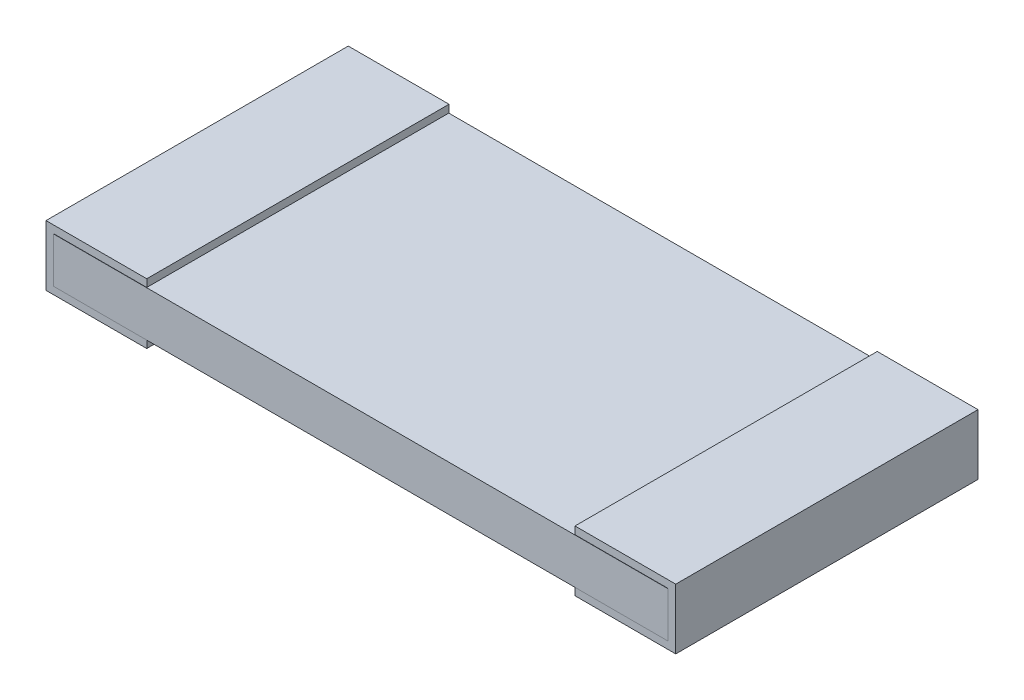
ISO-10303-21;
HEADER;
FILE_DESCRIPTION(('STEP AP214'),'2;1');
FILE_NAME('part.step','',(''),(''),'','','');
FILE_SCHEMA(('AUTOMOTIVE_DESIGN { 1 0 10303 214 1 1 1 1 }'));
ENDSEC;
DATA;
#1=APPLICATION_CONTEXT('core data for automotive mechanical design processes');
#2=APPLICATION_PROTOCOL_DEFINITION('international standard','automotive_design',2000,#1);
#3=PRODUCT_CONTEXT('',#1,'mechanical');
#4=PRODUCT('Part','Part','',(#3));
#5=PRODUCT_RELATED_PRODUCT_CATEGORY('part','',(#4));
#6=PRODUCT_DEFINITION_FORMATION('','',#4);
#7=PRODUCT_DEFINITION_CONTEXT('part definition',#1,'design');
#8=PRODUCT_DEFINITION('design','',#6,#7);
#9=PRODUCT_DEFINITION_SHAPE('','',#8);
#10=(LENGTH_UNIT() NAMED_UNIT(*) SI_UNIT(.MILLI.,.METRE.));
#11=(NAMED_UNIT(*) PLANE_ANGLE_UNIT() SI_UNIT($,.RADIAN.));
#12=(NAMED_UNIT(*) SI_UNIT($,.STERADIAN.) SOLID_ANGLE_UNIT());
#13=UNCERTAINTY_MEASURE_WITH_UNIT(LENGTH_MEASURE(1.E-05),#10,'distance_accuracy_value','');
#14=(GEOMETRIC_REPRESENTATION_CONTEXT(3) GLOBAL_UNCERTAINTY_ASSIGNED_CONTEXT((#13)) GLOBAL_UNIT_ASSIGNED_CONTEXT((#10,
#11,#12)) REPRESENTATION_CONTEXT('',''));
#15=CARTESIAN_POINT('',(0.,0.,0.));
#16=DIRECTION('',(0.,0.,1.));
#17=DIRECTION('',(1.,0.,0.));
#18=AXIS2_PLACEMENT_3D('',#15,#16,#17);
#19=CARTESIAN_POINT('',(6.2738,0.0762000000000008,-1.524));
#20=DIRECTION('',(1.,0.,0.));
#21=DIRECTION('',(0.,0.,-1.));
#22=AXIS2_PLACEMENT_3D('',#19,#20,#21);
#23=PLANE('',#22);
#24=DIRECTION('',(0.,0.,1.));
#25=VECTOR('',#24,1.);
#26=CARTESIAN_POINT('',(6.2738,0.0762000000000008,-1.524));
#27=LINE('',#26,#25);
#28=CARTESIAN_POINT('',(6.2738,0.0762000000000008,1.52146));
#29=VERTEX_POINT('',#28);
#30=CARTESIAN_POINT('',(6.2738,0.0762000000000008,1.524));
#31=VERTEX_POINT('',#30);
#32=EDGE_CURVE('E11',#29,#31,#27,.T.);
#33=ORIENTED_EDGE('',*,*,#32,.F.);
#34=DIRECTION('',(0.,-1.,0.));
#35=VECTOR('',#34,1.);
#36=CARTESIAN_POINT('',(6.2738,0.5334,1.52146));
#37=LINE('',#36,#35);
#38=CARTESIAN_POINT('',(6.2738,0.5334,1.52146));
#39=VERTEX_POINT('',#38);
#40=EDGE_CURVE('E212',#39,#29,#37,.T.);
#41=ORIENTED_EDGE('',*,*,#40,.F.);
#42=DIRECTION('',(0.,0.,1.));
#43=VECTOR('',#42,1.);
#44=CARTESIAN_POINT('',(6.2738,0.5334,-1.524));
#45=LINE('',#44,#43);
#46=CARTESIAN_POINT('',(6.2738,0.5334,1.524));
#47=VERTEX_POINT('',#46);
#48=EDGE_CURVE('E34',#39,#47,#45,.T.);
#49=ORIENTED_EDGE('',*,*,#48,.T.);
#50=DIRECTION('',(0.,1.,0.));
#51=VECTOR('',#50,1.);
#52=CARTESIAN_POINT('',(6.2738,0.0762000000000008,1.524));
#53=LINE('',#52,#51);
#54=EDGE_CURVE('E300',#31,#47,#53,.T.);
#55=ORIENTED_EDGE('',*,*,#54,.F.);
#56=EDGE_LOOP('',(#33,#41,#49,#55));
#57=FACE_BOUND('',#56,.T.);
#58=ADVANCED_FACE('F31',(#57),#23,.T.);
#59=CARTESIAN_POINT('',(6.2738,0.0762000000000008,-1.524));
#60=DIRECTION('',(0.,-1.,0.));
#61=DIRECTION('',(1.,0.,0.));
#62=AXIS2_PLACEMENT_3D('',#59,#60,#61);
#63=PLANE('',#62);
#64=DIRECTION('',(1.,0.,0.));
#65=VECTOR('',#64,1.);
#66=CARTESIAN_POINT('',(6.2738,0.0762000000000008,-1.524));
#67=LINE('',#66,#65);
#68=CARTESIAN_POINT('',(1.016,0.0762000000000003,-1.524));
#69=VERTEX_POINT('',#68);
#70=CARTESIAN_POINT('',(5.334,0.0762000000000007,-1.524));
#71=VERTEX_POINT('',#70);
#72=EDGE_CURVE('E333',#69,#71,#67,.T.);
#73=ORIENTED_EDGE('',*,*,#72,.T.);
#74=DIRECTION('',(0.,0.,-1.));
#75=VECTOR('',#74,1.);
#76=CARTESIAN_POINT('',(5.334,0.0762000000000003,1.52146));
#77=LINE('',#76,#75);
#78=CARTESIAN_POINT('',(5.334,0.0762000000000007,1.52146));
#79=VERTEX_POINT('',#78);
#80=EDGE_CURVE('E47',#79,#71,#77,.T.);
#81=ORIENTED_EDGE('',*,*,#80,.F.);
#82=DIRECTION('',(-1.,0.,0.));
#83=VECTOR('',#82,1.);
#84=CARTESIAN_POINT('',(6.2738,0.0762000000000002,1.52146));
#85=LINE('',#84,#83);
#86=EDGE_CURVE('E50',#29,#79,#85,.T.);
#87=ORIENTED_EDGE('',*,*,#86,.F.);
#88=ORIENTED_EDGE('',*,*,#32,.T.);
#89=DIRECTION('',(1.,0.,0.));
#90=VECTOR('',#89,1.);
#91=CARTESIAN_POINT('',(6.2738,0.0762000000000008,1.524));
#92=LINE('',#91,#90);
#93=CARTESIAN_POINT('',(0.0762,0.0762000000000002,1.524));
#94=VERTEX_POINT('',#93);
#95=EDGE_CURVE('E321',#94,#31,#92,.T.);
#96=ORIENTED_EDGE('',*,*,#95,.F.);
#97=DIRECTION('',(0.,0.,1.));
#98=VECTOR('',#97,1.);
#99=CARTESIAN_POINT('',(0.0762,0.0762000000000002,-1.524));
#100=LINE('',#99,#98);
#101=CARTESIAN_POINT('',(0.0762,0.0762000000000002,1.52146));
#102=VERTEX_POINT('',#101);
#103=EDGE_CURVE('E39',#102,#94,#100,.T.);
#104=ORIENTED_EDGE('',*,*,#103,.F.);
#105=DIRECTION('',(1.,0.,0.));
#106=VECTOR('',#105,1.);
#107=CARTESIAN_POINT('',(0.0762,0.0762000000000002,1.52146));
#108=LINE('',#107,#106);
#109=CARTESIAN_POINT('',(1.016,0.0762000000000003,1.52146));
#110=VERTEX_POINT('',#109);
#111=EDGE_CURVE('E267',#102,#110,#108,.T.);
#112=ORIENTED_EDGE('',*,*,#111,.T.);
#113=DIRECTION('',(0.,0.,-1.));
#114=VECTOR('',#113,1.);
#115=CARTESIAN_POINT('',(1.016,0.0762000000000003,1.52146));
#116=LINE('',#115,#114);
#117=EDGE_CURVE('E303',#110,#69,#116,.T.);
#118=ORIENTED_EDGE('',*,*,#117,.T.);
#119=EDGE_LOOP('',(#73,#81,#87,#88,#96,#104,#112,#118));
#120=FACE_BOUND('',#119,.T.);
#121=ADVANCED_FACE('F357',(#120),#63,.T.);
#122=CARTESIAN_POINT('',(0.0761999999999999,0.5334,-1.524));
#123=DIRECTION('',(0.,1.,0.));
#124=DIRECTION('',(0.,0.,1.));
#125=AXIS2_PLACEMENT_3D('',#122,#123,#124);
#126=PLANE('',#125);
#127=DIRECTION('',(1.,0.,0.));
#128=VECTOR('',#127,1.);
#129=CARTESIAN_POINT('',(5.334,0.5334,1.52146));
#130=LINE('',#129,#128);
#131=CARTESIAN_POINT('',(5.334,0.5334,1.52146));
#132=VERTEX_POINT('',#131);
#133=EDGE_CURVE('E215',#132,#39,#130,.T.);
#134=ORIENTED_EDGE('',*,*,#133,.F.);
#135=DIRECTION('',(0.,0.,-1.));
#136=VECTOR('',#135,1.);
#137=CARTESIAN_POINT('',(5.334,0.5334,1.52146));
#138=LINE('',#137,#136);
#139=CARTESIAN_POINT('',(5.334,0.5334,-1.524));
#140=VERTEX_POINT('',#139);
#141=EDGE_CURVE('E243',#132,#140,#138,.T.);
#142=ORIENTED_EDGE('',*,*,#141,.T.);
#143=DIRECTION('',(-1.,0.,0.));
#144=VECTOR('',#143,1.);
#145=CARTESIAN_POINT('',(0.0761999999999999,0.5334,-1.524));
#146=LINE('',#145,#144);
#147=CARTESIAN_POINT('',(1.016,0.5334,-1.524));
#148=VERTEX_POINT('',#147);
#149=EDGE_CURVE('E326',#140,#148,#146,.T.);
#150=ORIENTED_EDGE('',*,*,#149,.T.);
#151=DIRECTION('',(0.,0.,-1.));
#152=VECTOR('',#151,1.);
#153=CARTESIAN_POINT('',(1.016,0.5334,1.52146));
#154=LINE('',#153,#152);
#155=CARTESIAN_POINT('',(1.016,0.5334,1.52146));
#156=VERTEX_POINT('',#155);
#157=EDGE_CURVE('E310',#156,#148,#154,.T.);
#158=ORIENTED_EDGE('',*,*,#157,.F.);
#159=DIRECTION('',(-1.,0.,0.));
#160=VECTOR('',#159,1.);
#161=CARTESIAN_POINT('',(1.016,0.5334,1.52146));
#162=LINE('',#161,#160);
#163=CARTESIAN_POINT('',(0.0761999999999999,0.5334,1.52146));
#164=VERTEX_POINT('',#163);
#165=EDGE_CURVE('E263',#156,#164,#162,.T.);
#166=ORIENTED_EDGE('',*,*,#165,.T.);
#167=DIRECTION('',(0.,0.,1.));
#168=VECTOR('',#167,1.);
#169=CARTESIAN_POINT('',(0.0761999999999999,0.5334,-1.524));
#170=LINE('',#169,#168);
#171=CARTESIAN_POINT('',(0.0761999999999999,0.5334,1.524));
#172=VERTEX_POINT('',#171);
#173=EDGE_CURVE('E344',#164,#172,#170,.T.);
#174=ORIENTED_EDGE('',*,*,#173,.T.);
#175=DIRECTION('',(-1.,0.,0.));
#176=VECTOR('',#175,1.);
#177=CARTESIAN_POINT('',(0.0761999999999999,0.5334,1.524));
#178=LINE('',#177,#176);
#179=EDGE_CURVE('E336',#47,#172,#178,.T.);
#180=ORIENTED_EDGE('',*,*,#179,.F.);
#181=ORIENTED_EDGE('',*,*,#48,.F.);
#182=EDGE_LOOP('',(#134,#142,#150,#158,#166,#174,#180,#181));
#183=FACE_BOUND('',#182,.T.);
#184=ADVANCED_FACE('F352',(#183),#126,.T.);
#185=CARTESIAN_POINT('',(0.0761999999999999,0.5334,-1.524));
#186=DIRECTION('',(-1.,0.,0.));
#187=DIRECTION('',(0.,-1.,0.));
#188=AXIS2_PLACEMENT_3D('',#185,#186,#187);
#189=PLANE('',#188);
#190=ORIENTED_EDGE('',*,*,#173,.F.);
#191=DIRECTION('',(0.,-1.,0.));
#192=VECTOR('',#191,1.);
#193=CARTESIAN_POINT('',(0.0761999999999999,0.5334,1.52146));
#194=LINE('',#193,#192);
#195=EDGE_CURVE('E265',#164,#102,#194,.T.);
#196=ORIENTED_EDGE('',*,*,#195,.T.);
#197=ORIENTED_EDGE('',*,*,#103,.T.);
#198=DIRECTION('',(0.,-1.,0.));
#199=VECTOR('',#198,1.);
#200=CARTESIAN_POINT('',(0.0761999999999999,0.5334,1.524));
#201=LINE('',#200,#199);
#202=EDGE_CURVE('E339',#172,#94,#201,.T.);
#203=ORIENTED_EDGE('',*,*,#202,.F.);
#204=EDGE_LOOP('',(#190,#196,#197,#203));
#205=FACE_BOUND('',#204,.T.);
#206=ADVANCED_FACE('F420',(#205),#189,.T.);
#207=CARTESIAN_POINT('',(6.2738,0.5334,-1.524));
#208=DIRECTION('',(0.,0.,-1.));
#209=DIRECTION('',(-1.,0.,0.));
#210=AXIS2_PLACEMENT_3D('',#207,#208,#209);
#211=PLANE('',#210);
#212=DIRECTION('',(0.,1.,0.));
#213=VECTOR('',#212,1.);
#214=CARTESIAN_POINT('',(6.2738,0.0762000000000008,-1.524));
#215=LINE('',#214,#213);
#216=CARTESIAN_POINT('',(6.2738,0.0762000000000002,-1.524));
#217=VERTEX_POINT('',#216);
#218=CARTESIAN_POINT('',(6.2738,0.5334,-1.524));
#219=VERTEX_POINT('',#218);
#220=EDGE_CURVE('E317',#217,#219,#215,.T.);
#221=ORIENTED_EDGE('',*,*,#220,.F.);
#222=EDGE_CURVE('E329',#71,#217,#67,.T.);
#223=ORIENTED_EDGE('',*,*,#222,.F.);
#224=ORIENTED_EDGE('',*,*,#72,.F.);
#225=CARTESIAN_POINT('',(0.0762,0.0762000000000002,-1.524));
#226=VERTEX_POINT('',#225);
#227=EDGE_CURVE('E330',#226,#69,#67,.T.);
#228=ORIENTED_EDGE('',*,*,#227,.F.);
#229=DIRECTION('',(0.,-1.,0.));
#230=VECTOR('',#229,1.);
#231=CARTESIAN_POINT('',(0.0761999999999999,0.5334,-1.524));
#232=LINE('',#231,#230);
#233=CARTESIAN_POINT('',(0.0761999999999999,0.5334,-1.524));
#234=VERTEX_POINT('',#233);
#235=EDGE_CURVE('E325',#234,#226,#232,.T.);
#236=ORIENTED_EDGE('',*,*,#235,.F.);
#237=EDGE_CURVE('E320',#148,#234,#146,.T.);
#238=ORIENTED_EDGE('',*,*,#237,.F.);
#239=ORIENTED_EDGE('',*,*,#149,.F.);
#240=EDGE_CURVE('E322',#219,#140,#146,.T.);
#241=ORIENTED_EDGE('',*,*,#240,.F.);
#242=EDGE_LOOP('',(#221,#223,#224,#228,#236,#238,#239,#241));
#243=FACE_BOUND('',#242,.T.);
#244=ADVANCED_FACE('F366',(#243),#211,.T.);
#245=CARTESIAN_POINT('',(6.2738,0.5334,1.524));
#246=DIRECTION('',(0.,0.,-1.));
#247=DIRECTION('',(-1.,0.,0.));
#248=AXIS2_PLACEMENT_3D('',#245,#246,#247);
#249=PLANE('',#248);
#250=ORIENTED_EDGE('',*,*,#54,.T.);
#251=ORIENTED_EDGE('',*,*,#179,.T.);
#252=ORIENTED_EDGE('',*,*,#202,.T.);
#253=ORIENTED_EDGE('',*,*,#95,.T.);
#254=EDGE_LOOP('',(#250,#251,#252,#253));
#255=FACE_BOUND('',#254,.T.);
#256=ADVANCED_FACE('F354',(#255),#249,.F.);
#257=CARTESIAN_POINT('',(0.,0.,1.52146));
#258=DIRECTION('',(-1.,0.,0.));
#259=DIRECTION('',(0.,0.,1.));
#260=AXIS2_PLACEMENT_3D('',#257,#258,#259);
#261=PLANE('',#260);
#262=DIRECTION('',(0.,1.,0.));
#263=VECTOR('',#262,1.);
#264=CARTESIAN_POINT('',(0.,0.,-1.52654));
#265=LINE('',#264,#263);
#266=CARTESIAN_POINT('',(0.,0.,-1.52654));
#267=VERTEX_POINT('',#266);
#268=CARTESIAN_POINT('',(0.,0.6096,-1.52654));
#269=VERTEX_POINT('',#268);
#270=EDGE_CURVE('E239',#267,#269,#265,.T.);
#271=ORIENTED_EDGE('',*,*,#270,.F.);
#272=DIRECTION('',(0.,0.,-1.));
#273=VECTOR('',#272,1.);
#274=CARTESIAN_POINT('',(0.,0.,1.52146));
#275=LINE('',#274,#273);
#276=CARTESIAN_POINT('',(0.,0.,1.52146));
#277=VERTEX_POINT('',#276);
#278=EDGE_CURVE('E298',#277,#267,#275,.T.);
#279=ORIENTED_EDGE('',*,*,#278,.F.);
#280=DIRECTION('',(0.,1.,0.));
#281=VECTOR('',#280,1.);
#282=CARTESIAN_POINT('',(0.,0.,1.52146));
#283=LINE('',#282,#281);
#284=CARTESIAN_POINT('',(0.,0.6096,1.52146));
#285=VERTEX_POINT('',#284);
#286=EDGE_CURVE('E253',#277,#285,#283,.T.);
#287=ORIENTED_EDGE('',*,*,#286,.T.);
#288=DIRECTION('',(0.,0.,-1.));
#289=VECTOR('',#288,1.);
#290=CARTESIAN_POINT('',(0.,0.6096,1.52146));
#291=LINE('',#290,#289);
#292=EDGE_CURVE('E275',#285,#269,#291,.T.);
#293=ORIENTED_EDGE('',*,*,#292,.T.);
#294=EDGE_LOOP('',(#271,#279,#287,#293));
#295=FACE_BOUND('',#294,.T.);
#296=ADVANCED_FACE('F437',(#295),#261,.T.);
#297=CARTESIAN_POINT('',(0.,0.,1.52146));
#298=DIRECTION('',(0.,-1.,0.));
#299=DIRECTION('',(1.,0.,0.));
#300=AXIS2_PLACEMENT_3D('',#297,#298,#299);
#301=PLANE('',#300);
#302=DIRECTION('',(-1.,0.,0.));
#303=VECTOR('',#302,1.);
#304=CARTESIAN_POINT('',(0.,0.,-1.52654));
#305=LINE('',#304,#303);
#306=CARTESIAN_POINT('',(1.016,0.,-1.52654));
#307=VERTEX_POINT('',#306);
#308=EDGE_CURVE('E257',#307,#267,#305,.T.);
#309=ORIENTED_EDGE('',*,*,#308,.F.);
#310=DIRECTION('',(0.,0.,-1.));
#311=VECTOR('',#310,1.);
#312=CARTESIAN_POINT('',(1.016,0.,1.52146));
#313=LINE('',#312,#311);
#314=CARTESIAN_POINT('',(1.016,0.,1.52146));
#315=VERTEX_POINT('',#314);
#316=EDGE_CURVE('E301',#315,#307,#313,.T.);
#317=ORIENTED_EDGE('',*,*,#316,.F.);
#318=DIRECTION('',(-1.,0.,0.));
#319=VECTOR('',#318,1.);
#320=CARTESIAN_POINT('',(0.,0.,1.52146));
#321=LINE('',#320,#319);
#322=EDGE_CURVE('E272',#315,#277,#321,.T.);
#323=ORIENTED_EDGE('',*,*,#322,.T.);
#324=ORIENTED_EDGE('',*,*,#278,.T.);
#325=EDGE_LOOP('',(#309,#317,#323,#324));
#326=FACE_BOUND('',#325,.T.);
#327=ADVANCED_FACE('F441',(#326),#301,.T.);
#328=CARTESIAN_POINT('',(1.016,0.,1.52146));
#329=DIRECTION('',(1.,0.,0.));
#330=DIRECTION('',(0.,0.,-1.));
#331=AXIS2_PLACEMENT_3D('',#328,#329,#330);
#332=PLANE('',#331);
#333=DIRECTION('',(0.,-1.,0.));
#334=VECTOR('',#333,1.);
#335=CARTESIAN_POINT('',(1.016,0.,-1.52654));
#336=LINE('',#335,#334);
#337=CARTESIAN_POINT('',(1.016,0.0762000000000003,-1.52654));
#338=VERTEX_POINT('',#337);
#339=EDGE_CURVE('E293',#338,#307,#336,.T.);
#340=ORIENTED_EDGE('',*,*,#339,.F.);
#341=EDGE_CURVE('E305',#69,#338,#116,.T.);
#342=ORIENTED_EDGE('',*,*,#341,.F.);
#343=ORIENTED_EDGE('',*,*,#117,.F.);
#344=DIRECTION('',(0.,-1.,0.));
#345=VECTOR('',#344,1.);
#346=CARTESIAN_POINT('',(1.016,0.,1.52146));
#347=LINE('',#346,#345);
#348=EDGE_CURVE('E269',#110,#315,#347,.T.);
#349=ORIENTED_EDGE('',*,*,#348,.T.);
#350=ORIENTED_EDGE('',*,*,#316,.T.);
#351=EDGE_LOOP('',(#340,#342,#343,#349,#350));
#352=FACE_BOUND('',#351,.T.);
#353=ADVANCED_FACE('F397',(#352),#332,.T.);
#354=CARTESIAN_POINT('',(0.0762,0.0762000000000002,1.52146));
#355=DIRECTION('',(0.,1.,0.));
#356=DIRECTION('',(-1.,0.,0.));
#357=AXIS2_PLACEMENT_3D('',#354,#355,#356);
#358=PLANE('',#357);
#359=DIRECTION('',(0.,0.,-1.));
#360=VECTOR('',#359,1.);
#361=CARTESIAN_POINT('',(0.0762,0.0762000000000002,1.52146));
#362=LINE('',#361,#360);
#363=CARTESIAN_POINT('',(0.0762,0.0762000000000002,-1.52654));
#364=VERTEX_POINT('',#363);
#365=EDGE_CURVE('E306',#226,#364,#362,.T.);
#366=ORIENTED_EDGE('',*,*,#365,.F.);
#367=ORIENTED_EDGE('',*,*,#227,.T.);
#368=ORIENTED_EDGE('',*,*,#341,.T.);
#369=DIRECTION('',(1.,0.,0.));
#370=VECTOR('',#369,1.);
#371=CARTESIAN_POINT('',(0.0762,0.0762000000000002,-1.52654));
#372=LINE('',#371,#370);
#373=EDGE_CURVE('E290',#364,#338,#372,.T.);
#374=ORIENTED_EDGE('',*,*,#373,.F.);
#375=EDGE_LOOP('',(#366,#367,#368,#374));
#376=FACE_BOUND('',#375,.T.);
#377=ADVANCED_FACE('F393',(#376),#358,.T.);
#378=CARTESIAN_POINT('',(0.0761999999999999,0.5334,1.52146));
#379=DIRECTION('',(1.,0.,0.));
#380=DIRECTION('',(0.,1.,0.));
#381=AXIS2_PLACEMENT_3D('',#378,#379,#380);
#382=PLANE('',#381);
#383=DIRECTION('',(0.,0.,-1.));
#384=VECTOR('',#383,1.);
#385=CARTESIAN_POINT('',(0.0761999999999999,0.5334,1.52146));
#386=LINE('',#385,#384);
#387=CARTESIAN_POINT('',(0.0761999999999999,0.5334,-1.52654));
#388=VERTEX_POINT('',#387);
#389=EDGE_CURVE('E308',#234,#388,#386,.T.);
#390=ORIENTED_EDGE('',*,*,#389,.F.);
#391=ORIENTED_EDGE('',*,*,#235,.T.);
#392=ORIENTED_EDGE('',*,*,#365,.T.);
#393=DIRECTION('',(0.,-1.,0.));
#394=VECTOR('',#393,1.);
#395=CARTESIAN_POINT('',(0.0761999999999999,0.5334,-1.52654));
#396=LINE('',#395,#394);
#397=EDGE_CURVE('E287',#388,#364,#396,.T.);
#398=ORIENTED_EDGE('',*,*,#397,.F.);
#399=EDGE_LOOP('',(#390,#391,#392,#398));
#400=FACE_BOUND('',#399,.T.);
#401=ADVANCED_FACE('F406',(#400),#382,.T.);
#402=CARTESIAN_POINT('',(1.016,0.5334,1.52146));
#403=DIRECTION('',(0.,-1.,0.));
#404=DIRECTION('',(0.,0.,-1.));
#405=AXIS2_PLACEMENT_3D('',#402,#403,#404);
#406=PLANE('',#405);
#407=CARTESIAN_POINT('',(1.016,0.5334,-1.52654));
#408=VERTEX_POINT('',#407);
#409=EDGE_CURVE('E313',#148,#408,#154,.T.);
#410=ORIENTED_EDGE('',*,*,#409,.F.);
#411=ORIENTED_EDGE('',*,*,#237,.T.);
#412=ORIENTED_EDGE('',*,*,#389,.T.);
#413=DIRECTION('',(-1.,0.,0.));
#414=VECTOR('',#413,1.);
#415=CARTESIAN_POINT('',(1.016,0.5334,-1.52654));
#416=LINE('',#415,#414);
#417=EDGE_CURVE('E284',#408,#388,#416,.T.);
#418=ORIENTED_EDGE('',*,*,#417,.F.);
#419=EDGE_LOOP('',(#410,#411,#412,#418));
#420=FACE_BOUND('',#419,.T.);
#421=ADVANCED_FACE('F408',(#420),#406,.T.);
#422=CARTESIAN_POINT('',(1.016,0.6096,1.52146));
#423=DIRECTION('',(1.,0.,0.));
#424=DIRECTION('',(0.,1.,0.));
#425=AXIS2_PLACEMENT_3D('',#422,#423,#424);
#426=PLANE('',#425);
#427=DIRECTION('',(0.,-1.,0.));
#428=VECTOR('',#427,1.);
#429=CARTESIAN_POINT('',(1.016,0.6096,-1.52654));
#430=LINE('',#429,#428);
#431=CARTESIAN_POINT('',(1.016,0.6096,-1.52654));
#432=VERTEX_POINT('',#431);
#433=EDGE_CURVE('E281',#432,#408,#430,.T.);
#434=ORIENTED_EDGE('',*,*,#433,.F.);
#435=DIRECTION('',(0.,0.,-1.));
#436=VECTOR('',#435,1.);
#437=CARTESIAN_POINT('',(1.016,0.6096,1.52146));
#438=LINE('',#437,#436);
#439=CARTESIAN_POINT('',(1.016,0.6096,1.52146));
#440=VERTEX_POINT('',#439);
#441=EDGE_CURVE('E314',#440,#432,#438,.T.);
#442=ORIENTED_EDGE('',*,*,#441,.F.);
#443=DIRECTION('',(0.,-1.,0.));
#444=VECTOR('',#443,1.);
#445=CARTESIAN_POINT('',(1.016,0.6096,1.52146));
#446=LINE('',#445,#444);
#447=EDGE_CURVE('E260',#440,#156,#446,.T.);
#448=ORIENTED_EDGE('',*,*,#447,.T.);
#449=ORIENTED_EDGE('',*,*,#157,.T.);
#450=ORIENTED_EDGE('',*,*,#409,.T.);
#451=EDGE_LOOP('',(#434,#442,#448,#449,#450));
#452=FACE_BOUND('',#451,.T.);
#453=ADVANCED_FACE('F411',(#452),#426,.T.);
#454=CARTESIAN_POINT('',(0.,0.6096,1.52146));
#455=DIRECTION('',(0.,1.,0.));
#456=DIRECTION('',(0.,0.,1.));
#457=AXIS2_PLACEMENT_3D('',#454,#455,#456);
#458=PLANE('',#457);
#459=DIRECTION('',(1.,0.,0.));
#460=VECTOR('',#459,1.);
#461=CARTESIAN_POINT('',(0.,0.6096,-1.52654));
#462=LINE('',#461,#460);
#463=EDGE_CURVE('E278',#269,#432,#462,.T.);
#464=ORIENTED_EDGE('',*,*,#463,.F.);
#465=ORIENTED_EDGE('',*,*,#292,.F.);
#466=DIRECTION('',(1.,0.,0.));
#467=VECTOR('',#466,1.);
#468=CARTESIAN_POINT('',(0.,0.6096,1.52146));
#469=LINE('',#468,#467);
#470=EDGE_CURVE('E256',#285,#440,#469,.T.);
#471=ORIENTED_EDGE('',*,*,#470,.T.);
#472=ORIENTED_EDGE('',*,*,#441,.T.);
#473=EDGE_LOOP('',(#464,#465,#471,#472));
#474=FACE_BOUND('',#473,.T.);
#475=ADVANCED_FACE('F443',(#474),#458,.T.);
#476=CARTESIAN_POINT('',(0.,0.6096,1.52146));
#477=DIRECTION('',(0.,0.,-1.));
#478=DIRECTION('',(-1.,0.,0.));
#479=AXIS2_PLACEMENT_3D('',#476,#477,#478);
#480=PLANE('',#479);
#481=ORIENTED_EDGE('',*,*,#286,.F.);
#482=ORIENTED_EDGE('',*,*,#322,.F.);
#483=ORIENTED_EDGE('',*,*,#348,.F.);
#484=ORIENTED_EDGE('',*,*,#111,.F.);
#485=ORIENTED_EDGE('',*,*,#195,.F.);
#486=ORIENTED_EDGE('',*,*,#165,.F.);
#487=ORIENTED_EDGE('',*,*,#447,.F.);
#488=ORIENTED_EDGE('',*,*,#470,.F.);
#489=EDGE_LOOP('',(#481,#482,#483,#484,#485,#486,#487,#488));
#490=FACE_BOUND('',#489,.T.);
#491=ADVANCED_FACE('F417',(#490),#480,.F.);
#492=CARTESIAN_POINT('',(0.,0.6096,-1.52654));
#493=DIRECTION('',(0.,0.,-1.));
#494=DIRECTION('',(-1.,0.,0.));
#495=AXIS2_PLACEMENT_3D('',#492,#493,#494);
#496=PLANE('',#495);
#497=ORIENTED_EDGE('',*,*,#270,.T.);
#498=ORIENTED_EDGE('',*,*,#463,.T.);
#499=ORIENTED_EDGE('',*,*,#433,.T.);
#500=ORIENTED_EDGE('',*,*,#417,.T.);
#501=ORIENTED_EDGE('',*,*,#397,.T.);
#502=ORIENTED_EDGE('',*,*,#373,.T.);
#503=ORIENTED_EDGE('',*,*,#339,.T.);
#504=ORIENTED_EDGE('',*,*,#308,.T.);
#505=EDGE_LOOP('',(#497,#498,#499,#500,#501,#502,#503,#504));
#506=FACE_BOUND('',#505,.T.);
#507=ADVANCED_FACE('F401',(#506),#496,.T.);
#508=CARTESIAN_POINT('',(6.35,0.,1.52146));
#509=DIRECTION('',(-1.,0.,0.));
#510=DIRECTION('',(0.,0.,1.));
#511=AXIS2_PLACEMENT_3D('',#508,#509,#510);
#512=PLANE('',#511);
#513=DIRECTION('',(0.,1.,0.));
#514=VECTOR('',#513,1.);
#515=CARTESIAN_POINT('',(6.35,0.,-1.52654));
#516=LINE('',#515,#514);
#517=CARTESIAN_POINT('',(6.35,0.,-1.52654));
#518=VERTEX_POINT('',#517);
#519=CARTESIAN_POINT('',(6.35,0.6096,-1.52654));
#520=VERTEX_POINT('',#519);
#521=EDGE_CURVE('E222',#518,#520,#516,.T.);
#522=ORIENTED_EDGE('',*,*,#521,.T.);
#523=DIRECTION('',(0.,0.,-1.));
#524=VECTOR('',#523,1.);
#525=CARTESIAN_POINT('',(6.35,0.6096,1.52146));
#526=LINE('',#525,#524);
#527=CARTESIAN_POINT('',(6.35,0.6096,1.52146));
#528=VERTEX_POINT('',#527);
#529=EDGE_CURVE('E204',#528,#520,#526,.T.);
#530=ORIENTED_EDGE('',*,*,#529,.F.);
#531=DIRECTION('',(0.,1.,0.));
#532=VECTOR('',#531,1.);
#533=CARTESIAN_POINT('',(6.35,0.,1.52146));
#534=LINE('',#533,#532);
#535=CARTESIAN_POINT('',(6.35,0.,1.52146));
#536=VERTEX_POINT('',#535);
#537=EDGE_CURVE('E183',#536,#528,#534,.T.);
#538=ORIENTED_EDGE('',*,*,#537,.F.);
#539=DIRECTION('',(0.,0.,-1.));
#540=VECTOR('',#539,1.);
#541=CARTESIAN_POINT('',(6.35,0.,1.52146));
#542=LINE('',#541,#540);
#543=EDGE_CURVE('E192',#536,#518,#542,.T.);
#544=ORIENTED_EDGE('',*,*,#543,.T.);
#545=EDGE_LOOP('',(#522,#530,#538,#544));
#546=FACE_BOUND('',#545,.T.);
#547=ADVANCED_FACE('F202',(#546),#512,.F.);
#548=CARTESIAN_POINT('',(6.35,0.6096,1.52146));
#549=DIRECTION('',(0.,-1.,0.));
#550=DIRECTION('',(0.,0.,-1.));
#551=AXIS2_PLACEMENT_3D('',#548,#549,#550);
#552=PLANE('',#551);
#553=DIRECTION('',(-1.,0.,0.));
#554=VECTOR('',#553,1.);
#555=CARTESIAN_POINT('',(6.35,0.6096,-1.52654));
#556=LINE('',#555,#554);
#557=CARTESIAN_POINT('',(5.334,0.6096,-1.52654));
#558=VERTEX_POINT('',#557);
#559=EDGE_CURVE('E205',#520,#558,#556,.T.);
#560=ORIENTED_EDGE('',*,*,#559,.T.);
#561=DIRECTION('',(0.,0.,-1.));
#562=VECTOR('',#561,1.);
#563=CARTESIAN_POINT('',(5.334,0.6096,1.52146));
#564=LINE('',#563,#562);
#565=CARTESIAN_POINT('',(5.334,0.6096,1.52146));
#566=VERTEX_POINT('',#565);
#567=EDGE_CURVE('E240',#566,#558,#564,.T.);
#568=ORIENTED_EDGE('',*,*,#567,.F.);
#569=DIRECTION('',(-1.,0.,0.));
#570=VECTOR('',#569,1.);
#571=CARTESIAN_POINT('',(6.35,0.6096,1.52146));
#572=LINE('',#571,#570);
#573=EDGE_CURVE('E200',#528,#566,#572,.T.);
#574=ORIENTED_EDGE('',*,*,#573,.F.);
#575=ORIENTED_EDGE('',*,*,#529,.T.);
#576=EDGE_LOOP('',(#560,#568,#574,#575));
#577=FACE_BOUND('',#576,.T.);
#578=ADVANCED_FACE('F466',(#577),#552,.F.);
#579=CARTESIAN_POINT('',(5.334,0.6096,1.52146));
#580=DIRECTION('',(1.,0.,0.));
#581=DIRECTION('',(0.,1.,0.));
#582=AXIS2_PLACEMENT_3D('',#579,#580,#581);
#583=PLANE('',#582);
#584=DIRECTION('',(0.,-1.,0.));
#585=VECTOR('',#584,1.);
#586=CARTESIAN_POINT('',(5.334,0.6096,-1.52654));
#587=LINE('',#586,#585);
#588=CARTESIAN_POINT('',(5.334,0.5334,-1.52654));
#589=VERTEX_POINT('',#588);
#590=EDGE_CURVE('E207',#558,#589,#587,.T.);
#591=ORIENTED_EDGE('',*,*,#590,.T.);
#592=EDGE_CURVE('E245',#140,#589,#138,.T.);
#593=ORIENTED_EDGE('',*,*,#592,.F.);
#594=ORIENTED_EDGE('',*,*,#141,.F.);
#595=DIRECTION('',(0.,-1.,0.));
#596=VECTOR('',#595,1.);
#597=CARTESIAN_POINT('',(5.334,0.6096,1.52146));
#598=LINE('',#597,#596);
#599=EDGE_CURVE('E218',#566,#132,#598,.T.);
#600=ORIENTED_EDGE('',*,*,#599,.F.);
#601=ORIENTED_EDGE('',*,*,#567,.T.);
#602=EDGE_LOOP('',(#591,#593,#594,#600,#601));
#603=FACE_BOUND('',#602,.T.);
#604=ADVANCED_FACE('F372',(#603),#583,.F.);
#605=CARTESIAN_POINT('',(5.334,0.5334,1.52146));
#606=DIRECTION('',(0.,1.,0.));
#607=DIRECTION('',(0.,0.,1.));
#608=AXIS2_PLACEMENT_3D('',#605,#606,#607);
#609=PLANE('',#608);
#610=ORIENTED_EDGE('',*,*,#240,.T.);
#611=ORIENTED_EDGE('',*,*,#592,.T.);
#612=DIRECTION('',(1.,0.,0.));
#613=VECTOR('',#612,1.);
#614=CARTESIAN_POINT('',(5.334,0.5334,-1.52654));
#615=LINE('',#614,#613);
#616=CARTESIAN_POINT('',(6.2738,0.5334,-1.52654));
#617=VERTEX_POINT('',#616);
#618=EDGE_CURVE('E233',#589,#617,#615,.T.);
#619=ORIENTED_EDGE('',*,*,#618,.T.);
#620=DIRECTION('',(0.,0.,-1.));
#621=VECTOR('',#620,1.);
#622=CARTESIAN_POINT('',(6.2738,0.5334,1.52146));
#623=LINE('',#622,#621);
#624=EDGE_CURVE('E246',#219,#617,#623,.T.);
#625=ORIENTED_EDGE('',*,*,#624,.F.);
#626=EDGE_LOOP('',(#610,#611,#619,#625));
#627=FACE_BOUND('',#626,.T.);
#628=ADVANCED_FACE('F371',(#627),#609,.F.);
#629=CARTESIAN_POINT('',(6.2738,0.5334,1.52146));
#630=DIRECTION('',(1.,0.,0.));
#631=DIRECTION('',(0.,1.,0.));
#632=AXIS2_PLACEMENT_3D('',#629,#630,#631);
#633=PLANE('',#632);
#634=ORIENTED_EDGE('',*,*,#220,.T.);
#635=ORIENTED_EDGE('',*,*,#624,.T.);
#636=DIRECTION('',(0.,-1.,0.));
#637=VECTOR('',#636,1.);
#638=CARTESIAN_POINT('',(6.2738,0.5334,-1.52654));
#639=LINE('',#638,#637);
#640=CARTESIAN_POINT('',(6.2738,0.0762000000000002,-1.52654));
#641=VERTEX_POINT('',#640);
#642=EDGE_CURVE('E230',#617,#641,#639,.T.);
#643=ORIENTED_EDGE('',*,*,#642,.T.);
#644=DIRECTION('',(0.,0.,-1.));
#645=VECTOR('',#644,1.);
#646=CARTESIAN_POINT('',(6.2738,0.0762000000000002,1.52146));
#647=LINE('',#646,#645);
#648=EDGE_CURVE('E248',#217,#641,#647,.T.);
#649=ORIENTED_EDGE('',*,*,#648,.F.);
#650=EDGE_LOOP('',(#634,#635,#643,#649));
#651=FACE_BOUND('',#650,.T.);
#652=ADVANCED_FACE('F383',(#651),#633,.F.);
#653=CARTESIAN_POINT('',(6.2738,0.0762000000000002,1.52146));
#654=DIRECTION('',(0.,-1.,0.));
#655=DIRECTION('',(1.,0.,0.));
#656=AXIS2_PLACEMENT_3D('',#653,#654,#655);
#657=PLANE('',#656);
#658=ORIENTED_EDGE('',*,*,#222,.T.);
#659=ORIENTED_EDGE('',*,*,#648,.T.);
#660=DIRECTION('',(-1.,0.,0.));
#661=VECTOR('',#660,1.);
#662=CARTESIAN_POINT('',(6.2738,0.0762000000000002,-1.52654));
#663=LINE('',#662,#661);
#664=CARTESIAN_POINT('',(5.334,0.0762000000000003,-1.52654));
#665=VERTEX_POINT('',#664);
#666=EDGE_CURVE('E227',#641,#665,#663,.T.);
#667=ORIENTED_EDGE('',*,*,#666,.T.);
#668=EDGE_CURVE('E251',#71,#665,#77,.T.);
#669=ORIENTED_EDGE('',*,*,#668,.F.);
#670=EDGE_LOOP('',(#658,#659,#667,#669));
#671=FACE_BOUND('',#670,.T.);
#672=ADVANCED_FACE('F388',(#671),#657,.F.);
#673=CARTESIAN_POINT('',(5.334,0.,1.52146));
#674=DIRECTION('',(1.,0.,0.));
#675=DIRECTION('',(0.,0.,-1.));
#676=AXIS2_PLACEMENT_3D('',#673,#674,#675);
#677=PLANE('',#676);
#678=DIRECTION('',(0.,-1.,0.));
#679=VECTOR('',#678,1.);
#680=CARTESIAN_POINT('',(5.334,0.,-1.52654));
#681=LINE('',#680,#679);
#682=CARTESIAN_POINT('',(5.334,0.,-1.52654));
#683=VERTEX_POINT('',#682);
#684=EDGE_CURVE('E225',#665,#683,#681,.T.);
#685=ORIENTED_EDGE('',*,*,#684,.T.);
#686=DIRECTION('',(0.,0.,-1.));
#687=VECTOR('',#686,1.);
#688=CARTESIAN_POINT('',(5.334,0.,1.52146));
#689=LINE('',#688,#687);
#690=CARTESIAN_POINT('',(5.334,0.,1.52146));
#691=VERTEX_POINT('',#690);
#692=EDGE_CURVE('E199',#691,#683,#689,.T.);
#693=ORIENTED_EDGE('',*,*,#692,.F.);
#694=DIRECTION('',(0.,-1.,0.));
#695=VECTOR('',#694,1.);
#696=CARTESIAN_POINT('',(5.334,0.,1.52146));
#697=LINE('',#696,#695);
#698=EDGE_CURVE('E186',#79,#691,#697,.T.);
#699=ORIENTED_EDGE('',*,*,#698,.F.);
#700=ORIENTED_EDGE('',*,*,#80,.T.);
#701=ORIENTED_EDGE('',*,*,#668,.T.);
#702=EDGE_LOOP('',(#685,#693,#699,#700,#701));
#703=FACE_BOUND('',#702,.T.);
#704=ADVANCED_FACE('F469',(#703),#677,.F.);
#705=CARTESIAN_POINT('',(6.35,0.,1.52146));
#706=DIRECTION('',(0.,1.,0.));
#707=DIRECTION('',(-1.,0.,0.));
#708=AXIS2_PLACEMENT_3D('',#705,#706,#707);
#709=PLANE('',#708);
#710=DIRECTION('',(1.,0.,0.));
#711=VECTOR('',#710,1.);
#712=CARTESIAN_POINT('',(6.35,0.,-1.52654));
#713=LINE('',#712,#711);
#714=EDGE_CURVE('E195',#683,#518,#713,.T.);
#715=ORIENTED_EDGE('',*,*,#714,.T.);
#716=ORIENTED_EDGE('',*,*,#543,.F.);
#717=DIRECTION('',(1.,0.,0.));
#718=VECTOR('',#717,1.);
#719=CARTESIAN_POINT('',(6.35,0.,1.52146));
#720=LINE('',#719,#718);
#721=EDGE_CURVE('E179',#691,#536,#720,.T.);
#722=ORIENTED_EDGE('',*,*,#721,.F.);
#723=ORIENTED_EDGE('',*,*,#692,.T.);
#724=EDGE_LOOP('',(#715,#716,#722,#723));
#725=FACE_BOUND('',#724,.T.);
#726=ADVANCED_FACE('F193',(#725),#709,.F.);
#727=CARTESIAN_POINT('',(6.35,0.6096,1.52146));
#728=DIRECTION('',(0.,0.,-1.));
#729=DIRECTION('',(1.,0.,0.));
#730=AXIS2_PLACEMENT_3D('',#727,#728,#729);
#731=PLANE('',#730);
#732=ORIENTED_EDGE('',*,*,#537,.T.);
#733=ORIENTED_EDGE('',*,*,#573,.T.);
#734=ORIENTED_EDGE('',*,*,#599,.T.);
#735=ORIENTED_EDGE('',*,*,#133,.T.);
#736=ORIENTED_EDGE('',*,*,#40,.T.);
#737=ORIENTED_EDGE('',*,*,#86,.T.);
#738=ORIENTED_EDGE('',*,*,#698,.T.);
#739=ORIENTED_EDGE('',*,*,#721,.T.);
#740=EDGE_LOOP('',(#732,#733,#734,#735,#736,#737,#738,#739));
#741=FACE_BOUND('',#740,.T.);
#742=ADVANCED_FACE('F181',(#741),#731,.F.);
#743=CARTESIAN_POINT('',(6.35,0.6096,-1.52654));
#744=DIRECTION('',(0.,0.,-1.));
#745=DIRECTION('',(1.,0.,0.));
#746=AXIS2_PLACEMENT_3D('',#743,#744,#745);
#747=PLANE('',#746);
#748=ORIENTED_EDGE('',*,*,#521,.F.);
#749=ORIENTED_EDGE('',*,*,#714,.F.);
#750=ORIENTED_EDGE('',*,*,#684,.F.);
#751=ORIENTED_EDGE('',*,*,#666,.F.);
#752=ORIENTED_EDGE('',*,*,#642,.F.);
#753=ORIENTED_EDGE('',*,*,#618,.F.);
#754=ORIENTED_EDGE('',*,*,#590,.F.);
#755=ORIENTED_EDGE('',*,*,#559,.F.);
#756=EDGE_LOOP('',(#748,#749,#750,#751,#752,#753,#754,#755));
#757=FACE_BOUND('',#756,.T.);
#758=ADVANCED_FACE('F378',(#757),#747,.T.);
#759=CLOSED_SHELL('',(#58,#121,#184,#206,#244,#256,#296,#327,#353,#377,#401,#421,#453,#475,#491,
#507,#547,#578,#604,#628,#652,#672,#704,#726,#742,#758));
#760=MANIFOLD_SOLID_BREP('B2',#759);
#761=ADVANCED_BREP_SHAPE_REPRESENTATION('',(#18,#760),#14);
#762=SHAPE_DEFINITION_REPRESENTATION(#9,#761);
ENDSEC;
END-ISO-10303-21;
